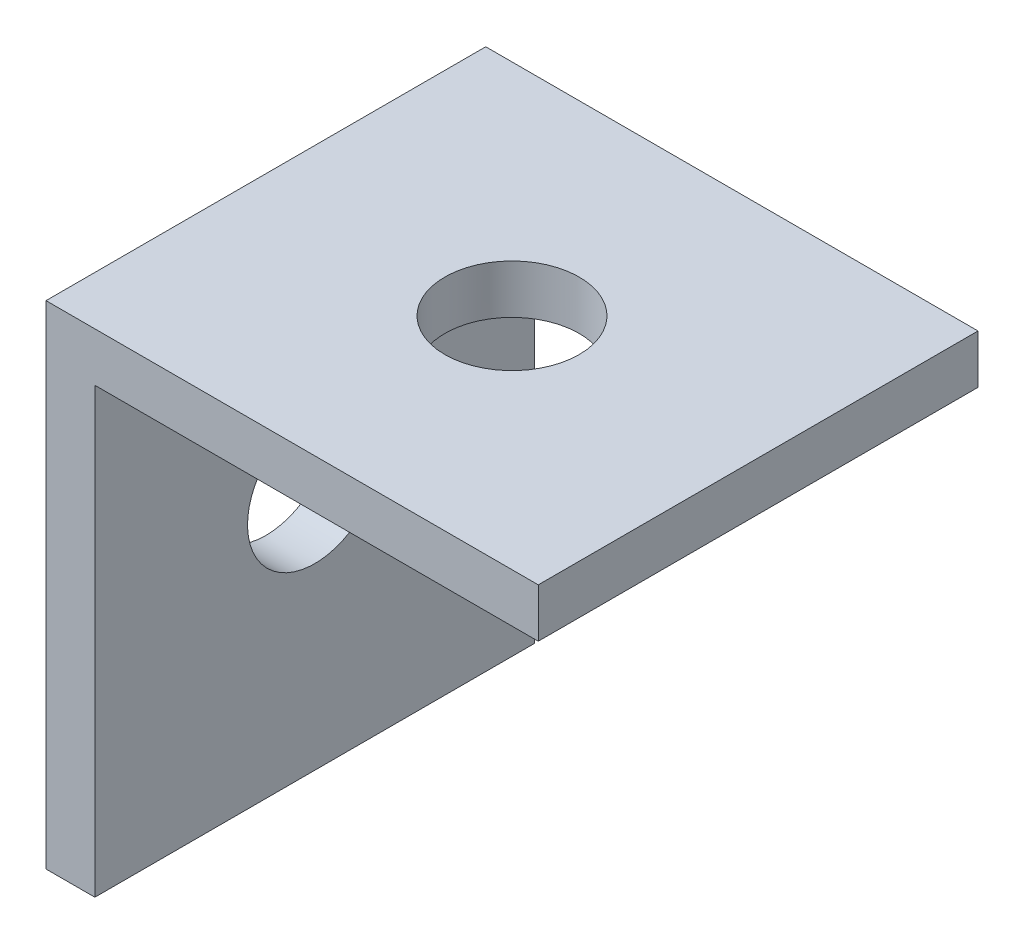
ISO-10303-21;
HEADER;
FILE_DESCRIPTION(('STEP AP214'),'2;1');
FILE_NAME('part.step','',(''),(''),'','','');
FILE_SCHEMA(('AUTOMOTIVE_DESIGN { 1 0 10303 214 1 1 1 1 }'));
ENDSEC;
DATA;
#1=APPLICATION_CONTEXT('core data for automotive mechanical design processes');
#2=APPLICATION_PROTOCOL_DEFINITION('international standard','automotive_design',2000,#1);
#3=PRODUCT_CONTEXT('',#1,'mechanical');
#4=PRODUCT('Part','Part','',(#3));
#5=PRODUCT_RELATED_PRODUCT_CATEGORY('part','',(#4));
#6=PRODUCT_DEFINITION_FORMATION('','',#4);
#7=PRODUCT_DEFINITION_CONTEXT('part definition',#1,'design');
#8=PRODUCT_DEFINITION('design','',#6,#7);
#9=PRODUCT_DEFINITION_SHAPE('','',#8);
#10=(LENGTH_UNIT() NAMED_UNIT(*) SI_UNIT(.MILLI.,.METRE.));
#11=(NAMED_UNIT(*) PLANE_ANGLE_UNIT() SI_UNIT($,.RADIAN.));
#12=(NAMED_UNIT(*) SI_UNIT($,.STERADIAN.) SOLID_ANGLE_UNIT());
#13=UNCERTAINTY_MEASURE_WITH_UNIT(LENGTH_MEASURE(1.E-05),#10,'distance_accuracy_value','');
#14=(GEOMETRIC_REPRESENTATION_CONTEXT(3) GLOBAL_UNCERTAINTY_ASSIGNED_CONTEXT((#13)) GLOBAL_UNIT_ASSIGNED_CONTEXT((#10,
#11,#12)) REPRESENTATION_CONTEXT('',''));
#15=CARTESIAN_POINT('',(0.,0.,0.));
#16=DIRECTION('',(0.,0.,1.));
#17=DIRECTION('',(1.,0.,0.));
#18=AXIS2_PLACEMENT_3D('',#15,#16,#17);
#19=CARTESIAN_POINT('',(0.,0.,-18.));
#20=DIRECTION('',(0.,1.,0.));
#21=DIRECTION('',(0.,0.,1.));
#22=AXIS2_PLACEMENT_3D('',#19,#20,#21);
#23=PLANE('',#22);
#24=CARTESIAN_POINT('',(10.075,0.,-9.));
#25=DIRECTION('',(0.,1.,0.));
#26=DIRECTION('',(0.,0.,1.));
#27=AXIS2_PLACEMENT_3D('',#24,#25,#26);
#28=CIRCLE('',#27,2.75);
#29=CARTESIAN_POINT('',(10.075,0.,-6.25));
#30=VERTEX_POINT('',#29);
#31=EDGE_CURVE('E124',#30,#30,#28,.T.);
#32=ORIENTED_EDGE('',*,*,#31,.F.);
#33=EDGE_LOOP('',(#32));
#34=FACE_BOUND('',#33,.T.);
#35=DIRECTION('',(-1.,0.,0.));
#36=VECTOR('',#35,1.);
#37=CARTESIAN_POINT('',(0.,0.,0.));
#38=LINE('',#37,#36);
#39=CARTESIAN_POINT('',(20.15,0.,0.));
#40=VERTEX_POINT('',#39);
#41=CARTESIAN_POINT('',(0.,0.,0.));
#42=VERTEX_POINT('',#41);
#43=EDGE_CURVE('E120',#40,#42,#38,.T.);
#44=ORIENTED_EDGE('',*,*,#43,.F.);
#45=DIRECTION('',(0.,0.,1.));
#46=VECTOR('',#45,1.);
#47=CARTESIAN_POINT('',(20.15,0.,-18.));
#48=LINE('',#47,#46);
#49=CARTESIAN_POINT('',(20.15,0.,-18.));
#50=VERTEX_POINT('',#49);
#51=EDGE_CURVE('E11',#50,#40,#48,.T.);
#52=ORIENTED_EDGE('',*,*,#51,.F.);
#53=DIRECTION('',(-1.,0.,0.));
#54=VECTOR('',#53,1.);
#55=CARTESIAN_POINT('',(0.,0.,-18.));
#56=LINE('',#55,#54);
#57=CARTESIAN_POINT('',(0.,0.,-18.));
#58=VERTEX_POINT('',#57);
#59=EDGE_CURVE('E135',#50,#58,#56,.T.);
#60=ORIENTED_EDGE('',*,*,#59,.T.);
#61=DIRECTION('',(0.,0.,1.));
#62=VECTOR('',#61,1.);
#63=CARTESIAN_POINT('',(0.,0.,-18.));
#64=LINE('',#63,#62);
#65=EDGE_CURVE('E84',#58,#42,#64,.T.);
#66=ORIENTED_EDGE('',*,*,#65,.T.);
#67=EDGE_LOOP('',(#44,#52,#60,#66));
#68=FACE_BOUND('',#67,.T.);
#69=ADVANCED_FACE('F34',(#34,#68),#23,.T.);
#70=CARTESIAN_POINT('',(20.15,-2.00000000000002,-18.));
#71=DIRECTION('',(1.,0.,0.));
#72=DIRECTION('',(0.,1.,0.));
#73=AXIS2_PLACEMENT_3D('',#70,#71,#72);
#74=PLANE('',#73);
#75=DIRECTION('',(0.,1.,0.));
#76=VECTOR('',#75,1.);
#77=CARTESIAN_POINT('',(20.15,-2.00000000000002,0.));
#78=LINE('',#77,#76);
#79=CARTESIAN_POINT('',(20.15,-2.00000000000002,0.));
#80=VERTEX_POINT('',#79);
#81=EDGE_CURVE('E133',#80,#40,#78,.T.);
#82=ORIENTED_EDGE('',*,*,#81,.F.);
#83=DIRECTION('',(0.,0.,1.));
#84=VECTOR('',#83,1.);
#85=CARTESIAN_POINT('',(20.15,-2.00000000000002,-18.));
#86=LINE('',#85,#84);
#87=CARTESIAN_POINT('',(20.15,-2.00000000000002,-18.));
#88=VERTEX_POINT('',#87);
#89=EDGE_CURVE('E43',#88,#80,#86,.T.);
#90=ORIENTED_EDGE('',*,*,#89,.F.);
#91=DIRECTION('',(0.,1.,0.));
#92=VECTOR('',#91,1.);
#93=CARTESIAN_POINT('',(20.15,-2.00000000000002,-18.));
#94=LINE('',#93,#92);
#95=EDGE_CURVE('E110',#88,#50,#94,.T.);
#96=ORIENTED_EDGE('',*,*,#95,.T.);
#97=ORIENTED_EDGE('',*,*,#51,.T.);
#98=EDGE_LOOP('',(#82,#90,#96,#97));
#99=FACE_BOUND('',#98,.T.);
#100=ADVANCED_FACE('F144',(#99),#74,.T.);
#101=CARTESIAN_POINT('',(2.,-2.00000000000002,-18.));
#102=DIRECTION('',(0.,-1.,0.));
#103=DIRECTION('',(1.,0.,0.));
#104=AXIS2_PLACEMENT_3D('',#101,#102,#103);
#105=PLANE('',#104);
#106=CARTESIAN_POINT('',(10.075,-2.00000000000002,-9.));
#107=DIRECTION('',(0.,-1.,0.));
#108=DIRECTION('',(1.,0.,0.));
#109=AXIS2_PLACEMENT_3D('',#106,#107,#108);
#110=CIRCLE('',#109,2.75);
#111=CARTESIAN_POINT('',(12.825,-2.00000000000002,-9.));
#112=VERTEX_POINT('',#111);
#113=EDGE_CURVE('E171',#112,#112,#110,.T.);
#114=ORIENTED_EDGE('',*,*,#113,.F.);
#115=EDGE_LOOP('',(#114));
#116=FACE_BOUND('',#115,.T.);
#117=DIRECTION('',(1.,0.,0.));
#118=VECTOR('',#117,1.);
#119=CARTESIAN_POINT('',(2.,-2.00000000000002,0.));
#120=LINE('',#119,#118);
#121=CARTESIAN_POINT('',(2.,-2.00000000000002,0.));
#122=VERTEX_POINT('',#121);
#123=EDGE_CURVE('E97',#122,#80,#120,.T.);
#124=ORIENTED_EDGE('',*,*,#123,.F.);
#125=DIRECTION('',(0.,0.,1.));
#126=VECTOR('',#125,1.);
#127=CARTESIAN_POINT('',(2.,-2.00000000000002,-18.));
#128=LINE('',#127,#126);
#129=CARTESIAN_POINT('',(2.,-2.00000000000002,-18.));
#130=VERTEX_POINT('',#129);
#131=EDGE_CURVE('E92',#130,#122,#128,.T.);
#132=ORIENTED_EDGE('',*,*,#131,.F.);
#133=DIRECTION('',(1.,0.,0.));
#134=VECTOR('',#133,1.);
#135=CARTESIAN_POINT('',(2.,-2.00000000000002,-18.));
#136=LINE('',#135,#134);
#137=EDGE_CURVE('E95',#130,#88,#136,.T.);
#138=ORIENTED_EDGE('',*,*,#137,.T.);
#139=ORIENTED_EDGE('',*,*,#89,.T.);
#140=EDGE_LOOP('',(#124,#132,#138,#139));
#141=FACE_BOUND('',#140,.T.);
#142=ADVANCED_FACE('F94',(#116,#141),#105,.T.);
#143=CARTESIAN_POINT('',(2.,-2.00000000000002,-18.));
#144=DIRECTION('',(1.,0.,0.));
#145=DIRECTION('',(0.,1.,0.));
#146=AXIS2_PLACEMENT_3D('',#143,#144,#145);
#147=PLANE('',#146);
#148=CARTESIAN_POINT('',(2.,-10.075,-9.));
#149=DIRECTION('',(1.,0.,0.));
#150=DIRECTION('',(0.,1.,0.));
#151=AXIS2_PLACEMENT_3D('',#148,#149,#150);
#152=CIRCLE('',#151,2.75);
#153=CARTESIAN_POINT('',(2.,-7.325,-9.));
#154=VERTEX_POINT('',#153);
#155=EDGE_CURVE('E172',#154,#154,#152,.T.);
#156=ORIENTED_EDGE('',*,*,#155,.F.);
#157=EDGE_LOOP('',(#156));
#158=FACE_BOUND('',#157,.T.);
#159=DIRECTION('',(0.,1.,0.));
#160=VECTOR('',#159,1.);
#161=CARTESIAN_POINT('',(2.,-2.00000000000002,0.));
#162=LINE('',#161,#160);
#163=CARTESIAN_POINT('',(2.,-20.15,0.));
#164=VERTEX_POINT('',#163);
#165=EDGE_CURVE('E130',#164,#122,#162,.T.);
#166=ORIENTED_EDGE('',*,*,#165,.F.);
#167=DIRECTION('',(0.,0.,1.));
#168=VECTOR('',#167,1.);
#169=CARTESIAN_POINT('',(2.,-20.15,-18.));
#170=LINE('',#169,#168);
#171=CARTESIAN_POINT('',(2.,-20.15,-18.));
#172=VERTEX_POINT('',#171);
#173=EDGE_CURVE('E102',#172,#164,#170,.T.);
#174=ORIENTED_EDGE('',*,*,#173,.F.);
#175=DIRECTION('',(0.,1.,0.));
#176=VECTOR('',#175,1.);
#177=CARTESIAN_POINT('',(2.,-2.00000000000002,-18.));
#178=LINE('',#177,#176);
#179=EDGE_CURVE('E108',#172,#130,#178,.T.);
#180=ORIENTED_EDGE('',*,*,#179,.T.);
#181=ORIENTED_EDGE('',*,*,#131,.T.);
#182=EDGE_LOOP('',(#166,#174,#180,#181));
#183=FACE_BOUND('',#182,.T.);
#184=ADVANCED_FACE('F112',(#158,#183),#147,.T.);
#185=CARTESIAN_POINT('',(2.,-20.15,-18.));
#186=DIRECTION('',(0.,-1.,0.));
#187=DIRECTION('',(0.,0.,-1.));
#188=AXIS2_PLACEMENT_3D('',#185,#186,#187);
#189=PLANE('',#188);
#190=DIRECTION('',(1.,0.,0.));
#191=VECTOR('',#190,1.);
#192=CARTESIAN_POINT('',(2.,-20.15,0.));
#193=LINE('',#192,#191);
#194=CARTESIAN_POINT('',(0.,-20.15,0.));
#195=VERTEX_POINT('',#194);
#196=EDGE_CURVE('E127',#195,#164,#193,.T.);
#197=ORIENTED_EDGE('',*,*,#196,.F.);
#198=DIRECTION('',(0.,0.,1.));
#199=VECTOR('',#198,1.);
#200=CARTESIAN_POINT('',(0.,-20.15,-18.));
#201=LINE('',#200,#199);
#202=CARTESIAN_POINT('',(0.,-20.15,-18.));
#203=VERTEX_POINT('',#202);
#204=EDGE_CURVE('E139',#203,#195,#201,.T.);
#205=ORIENTED_EDGE('',*,*,#204,.F.);
#206=DIRECTION('',(1.,0.,0.));
#207=VECTOR('',#206,1.);
#208=CARTESIAN_POINT('',(2.,-20.15,-18.));
#209=LINE('',#208,#207);
#210=EDGE_CURVE('E113',#203,#172,#209,.T.);
#211=ORIENTED_EDGE('',*,*,#210,.T.);
#212=ORIENTED_EDGE('',*,*,#173,.T.);
#213=EDGE_LOOP('',(#197,#205,#211,#212));
#214=FACE_BOUND('',#213,.T.);
#215=ADVANCED_FACE('F159',(#214),#189,.T.);
#216=CARTESIAN_POINT('',(0.,0.,-18.));
#217=DIRECTION('',(-1.,0.,0.));
#218=DIRECTION('',(0.,-1.,0.));
#219=AXIS2_PLACEMENT_3D('',#216,#217,#218);
#220=PLANE('',#219);
#221=CARTESIAN_POINT('',(0.,-10.075,-9.));
#222=DIRECTION('',(-1.,0.,0.));
#223=DIRECTION('',(0.,-1.,0.));
#224=AXIS2_PLACEMENT_3D('',#221,#222,#223);
#225=CIRCLE('',#224,2.75);
#226=CARTESIAN_POINT('',(0.,-12.825,-9.));
#227=VERTEX_POINT('',#226);
#228=EDGE_CURVE('E37',#227,#227,#225,.T.);
#229=ORIENTED_EDGE('',*,*,#228,.F.);
#230=EDGE_LOOP('',(#229));
#231=FACE_BOUND('',#230,.T.);
#232=DIRECTION('',(0.,-1.,0.));
#233=VECTOR('',#232,1.);
#234=CARTESIAN_POINT('',(0.,0.,0.));
#235=LINE('',#234,#233);
#236=EDGE_CURVE('E123',#42,#195,#235,.T.);
#237=ORIENTED_EDGE('',*,*,#236,.F.);
#238=ORIENTED_EDGE('',*,*,#65,.F.);
#239=DIRECTION('',(0.,-1.,0.));
#240=VECTOR('',#239,1.);
#241=CARTESIAN_POINT('',(0.,0.,-18.));
#242=LINE('',#241,#240);
#243=EDGE_CURVE('E115',#58,#203,#242,.T.);
#244=ORIENTED_EDGE('',*,*,#243,.T.);
#245=ORIENTED_EDGE('',*,*,#204,.T.);
#246=EDGE_LOOP('',(#237,#238,#244,#245));
#247=FACE_BOUND('',#246,.T.);
#248=ADVANCED_FACE('F140',(#231,#247),#220,.T.);
#249=CARTESIAN_POINT('',(0.,0.,-18.));
#250=DIRECTION('',(0.,0.,1.));
#251=DIRECTION('',(1.,0.,0.));
#252=AXIS2_PLACEMENT_3D('',#249,#250,#251);
#253=PLANE('',#252);
#254=ORIENTED_EDGE('',*,*,#59,.F.);
#255=ORIENTED_EDGE('',*,*,#95,.F.);
#256=ORIENTED_EDGE('',*,*,#137,.F.);
#257=ORIENTED_EDGE('',*,*,#179,.F.);
#258=ORIENTED_EDGE('',*,*,#210,.F.);
#259=ORIENTED_EDGE('',*,*,#243,.F.);
#260=EDGE_LOOP('',(#254,#255,#256,#257,#258,#259));
#261=FACE_BOUND('',#260,.T.);
#262=ADVANCED_FACE('F106',(#261),#253,.F.);
#263=CARTESIAN_POINT('',(0.,0.,0.));
#264=DIRECTION('',(0.,0.,1.));
#265=DIRECTION('',(1.,0.,0.));
#266=AXIS2_PLACEMENT_3D('',#263,#264,#265);
#267=PLANE('',#266);
#268=ORIENTED_EDGE('',*,*,#43,.T.);
#269=ORIENTED_EDGE('',*,*,#236,.T.);
#270=ORIENTED_EDGE('',*,*,#196,.T.);
#271=ORIENTED_EDGE('',*,*,#165,.T.);
#272=ORIENTED_EDGE('',*,*,#123,.T.);
#273=ORIENTED_EDGE('',*,*,#81,.T.);
#274=EDGE_LOOP('',(#268,#269,#270,#271,#272,#273));
#275=FACE_BOUND('',#274,.T.);
#276=ADVANCED_FACE('F143',(#275),#267,.T.);
#277=CARTESIAN_POINT('',(10.075,16.,-9.));
#278=DIRECTION('',(0.,-1.,0.));
#279=DIRECTION('',(1.,0.,0.));
#280=AXIS2_PLACEMENT_3D('',#277,#278,#279);
#281=CYLINDRICAL_SURFACE('',#280,2.75);
#282=ORIENTED_EDGE('',*,*,#31,.T.);
#283=EDGE_LOOP('',(#282));
#284=FACE_BOUND('',#283,.T.);
#285=ORIENTED_EDGE('',*,*,#113,.T.);
#286=EDGE_LOOP('',(#285));
#287=FACE_BOUND('',#286,.T.);
#288=ADVANCED_FACE('F184',(#284,#287),#281,.F.);
#289=CARTESIAN_POINT('',(-16.,-10.075,-9.));
#290=DIRECTION('',(1.,0.,0.));
#291=DIRECTION('',(0.,1.,0.));
#292=AXIS2_PLACEMENT_3D('',#289,#290,#291);
#293=CYLINDRICAL_SURFACE('',#292,2.75);
#294=ORIENTED_EDGE('',*,*,#228,.T.);
#295=EDGE_LOOP('',(#294));
#296=FACE_BOUND('',#295,.T.);
#297=ORIENTED_EDGE('',*,*,#155,.T.);
#298=EDGE_LOOP('',(#297));
#299=FACE_BOUND('',#298,.T.);
#300=ADVANCED_FACE('F187',(#296,#299),#293,.F.);
#301=CLOSED_SHELL('',(#69,#100,#142,#184,#215,#248,#262,#276,#288,#300));
#302=MANIFOLD_SOLID_BREP('B2',#301);
#303=ADVANCED_BREP_SHAPE_REPRESENTATION('',(#18,#302),#14);
#304=SHAPE_DEFINITION_REPRESENTATION(#9,#303);
ENDSEC;
END-ISO-10303-21;
